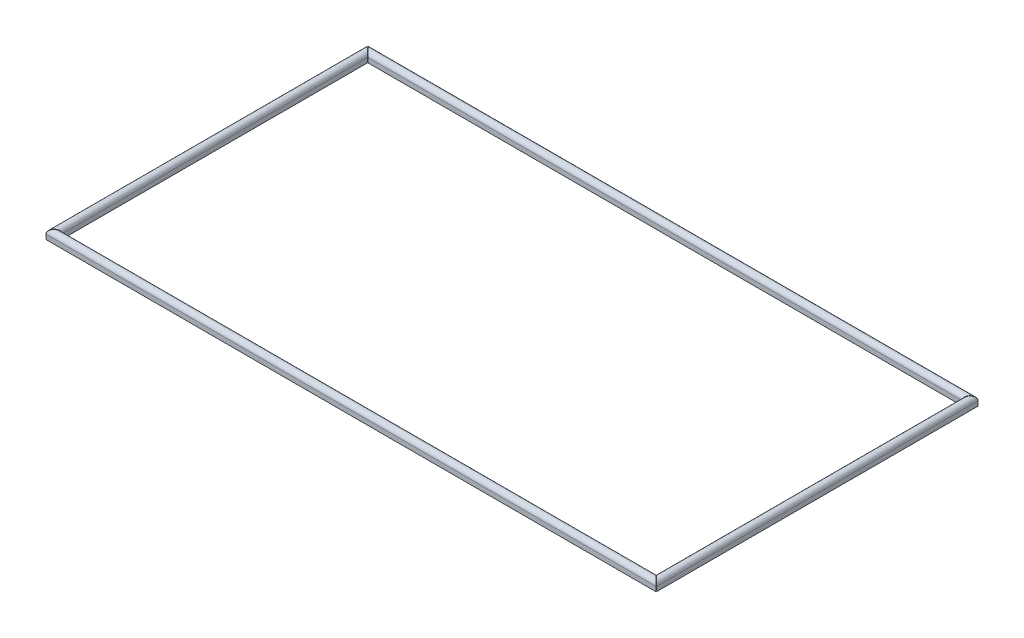
ISO-10303-21;
HEADER;
FILE_DESCRIPTION(('STEP AP214'),'2;1');
FILE_NAME('part.step','',(''),(''),'','','');
FILE_SCHEMA(('AUTOMOTIVE_DESIGN { 1 0 10303 214 1 1 1 1 }'));
ENDSEC;
DATA;
#1=APPLICATION_CONTEXT('core data for automotive mechanical design processes');
#2=APPLICATION_PROTOCOL_DEFINITION('international standard','automotive_design',2000,#1);
#3=PRODUCT_CONTEXT('',#1,'mechanical');
#4=PRODUCT('Part','Part','',(#3));
#5=PRODUCT_RELATED_PRODUCT_CATEGORY('part','',(#4));
#6=PRODUCT_DEFINITION_FORMATION('','',#4);
#7=PRODUCT_DEFINITION_CONTEXT('part definition',#1,'design');
#8=PRODUCT_DEFINITION('design','',#6,#7);
#9=PRODUCT_DEFINITION_SHAPE('','',#8);
#10=(LENGTH_UNIT() NAMED_UNIT(*) SI_UNIT(.MILLI.,.METRE.));
#11=(NAMED_UNIT(*) PLANE_ANGLE_UNIT() SI_UNIT($,.RADIAN.));
#12=(NAMED_UNIT(*) SI_UNIT($,.STERADIAN.) SOLID_ANGLE_UNIT());
#13=UNCERTAINTY_MEASURE_WITH_UNIT(LENGTH_MEASURE(1.E-05),#10,'distance_accuracy_value','');
#14=(GEOMETRIC_REPRESENTATION_CONTEXT(3) GLOBAL_UNCERTAINTY_ASSIGNED_CONTEXT((#13)) GLOBAL_UNIT_ASSIGNED_CONTEXT((#10,
#11,#12)) REPRESENTATION_CONTEXT('',''));
#15=CARTESIAN_POINT('',(0.,0.,0.));
#16=DIRECTION('',(0.,0.,1.));
#17=DIRECTION('',(1.,0.,0.));
#18=AXIS2_PLACEMENT_3D('',#15,#16,#17);
#19=CARTESIAN_POINT('',(12.5,7.,-6.));
#20=DIRECTION('',(1.,0.,0.));
#21=DIRECTION('',(0.,0.,-1.));
#22=AXIS2_PLACEMENT_3D('',#19,#20,#21);
#23=CYLINDRICAL_SURFACE('',#22,6.);
#24=DIRECTION('',(1.,0.,0.));
#25=VECTOR('',#24,1.);
#26=CARTESIAN_POINT('',(0.,7.,-12.));
#27=LINE('',#26,#25);
#28=CARTESIAN_POINT('',(12.5,7.,-12.));
#29=VERTEX_POINT('',#28);
#30=CARTESIAN_POINT('',(897.5,7.00000000000001,-12.));
#31=VERTEX_POINT('',#30);
#32=EDGE_CURVE('E116',#29,#31,#27,.T.);
#33=ORIENTED_EDGE('',*,*,#32,.F.);
#34=CARTESIAN_POINT('',(6.49999999999996,7.,-6.));
#35=DIRECTION('',(-0.707106781186549,0.,-0.707106781186546));
#36=DIRECTION('',(0.707106781186546,0.,-0.707106781186549));
#37=AXIS2_PLACEMENT_3D('',#34,#35,#36);
#38=ELLIPSE('',#37,8.48528137423856,6.);
#39=CARTESIAN_POINT('',(0.499999999999982,7.,0.));
#40=VERTEX_POINT('',#39);
#41=EDGE_CURVE('E58',#40,#29,#38,.T.);
#42=ORIENTED_EDGE('',*,*,#41,.F.);
#43=DIRECTION('',(1.,0.,0.));
#44=VECTOR('',#43,1.);
#45=CARTESIAN_POINT('',(0.,7.,0.));
#46=LINE('',#45,#44);
#47=CARTESIAN_POINT('',(909.5,6.99999999999997,0.));
#48=VERTEX_POINT('',#47);
#49=EDGE_CURVE('E122',#48,#40,#46,.F.);
#50=ORIENTED_EDGE('',*,*,#49,.F.);
#51=CARTESIAN_POINT('',(903.5,7.,-6.));
#52=DIRECTION('',(-0.707106781186552,0.,0.707106781186543));
#53=DIRECTION('',(0.707106781186543,0.,0.707106781186552));
#54=AXIS2_PLACEMENT_3D('',#51,#52,#53);
#55=ELLIPSE('',#54,8.48528137423851,6.);
#56=EDGE_CURVE('E12',#31,#48,#55,.F.);
#57=ORIENTED_EDGE('',*,*,#56,.F.);
#58=EDGE_LOOP('',(#33,#42,#50,#57));
#59=FACE_BOUND('',#58,.T.);
#60=ADVANCED_FACE('F50',(#59),#23,.T.);
#61=CARTESIAN_POINT('',(0.,13.,0.));
#62=DIRECTION('',(0.,0.,1.));
#63=DIRECTION('',(1.,0.,0.));
#64=AXIS2_PLACEMENT_3D('',#61,#62,#63);
#65=PLANE('',#64);
#66=DIRECTION('',(0.,1.,0.));
#67=VECTOR('',#66,1.);
#68=CARTESIAN_POINT('',(909.5,-27.,0.));
#69=LINE('',#68,#67);
#70=CARTESIAN_POINT('',(909.5,0.,0.));
#71=VERTEX_POINT('',#70);
#72=EDGE_CURVE('E97',#71,#48,#69,.T.);
#73=ORIENTED_EDGE('',*,*,#72,.T.);
#74=ORIENTED_EDGE('',*,*,#49,.T.);
#75=DIRECTION('',(0.,1.,0.));
#76=VECTOR('',#75,1.);
#77=CARTESIAN_POINT('',(0.499999999999982,-27.,0.));
#78=LINE('',#77,#76);
#79=CARTESIAN_POINT('',(0.499999999999982,0.,0.));
#80=VERTEX_POINT('',#79);
#81=EDGE_CURVE('E106',#80,#40,#78,.T.);
#82=ORIENTED_EDGE('',*,*,#81,.F.);
#83=DIRECTION('',(-1.,0.,0.));
#84=VECTOR('',#83,1.);
#85=CARTESIAN_POINT('',(0.,0.,0.));
#86=LINE('',#85,#84);
#87=EDGE_CURVE('E105',#71,#80,#86,.T.);
#88=ORIENTED_EDGE('',*,*,#87,.F.);
#89=EDGE_LOOP('',(#73,#74,#82,#88));
#90=FACE_BOUND('',#89,.T.);
#91=ADVANCED_FACE('F124',(#90),#65,.T.);
#92=CARTESIAN_POINT('',(0.,13.,-12.));
#93=DIRECTION('',(0.,0.,-1.));
#94=DIRECTION('',(-1.,0.,0.));
#95=AXIS2_PLACEMENT_3D('',#92,#93,#94);
#96=PLANE('',#95);
#97=DIRECTION('',(0.,1.,0.));
#98=VECTOR('',#97,1.);
#99=CARTESIAN_POINT('',(12.5,-27.,-12.));
#100=LINE('',#99,#98);
#101=CARTESIAN_POINT('',(12.4999999999999,0.,-12.));
#102=VERTEX_POINT('',#101);
#103=EDGE_CURVE('E87',#102,#29,#100,.T.);
#104=ORIENTED_EDGE('',*,*,#103,.T.);
#105=ORIENTED_EDGE('',*,*,#32,.T.);
#106=DIRECTION('',(0.,1.,0.));
#107=VECTOR('',#106,1.);
#108=CARTESIAN_POINT('',(897.5,-27.,-12.));
#109=LINE('',#108,#107);
#110=CARTESIAN_POINT('',(897.5,0.,-12.));
#111=VERTEX_POINT('',#110);
#112=EDGE_CURVE('E107',#111,#31,#109,.T.);
#113=ORIENTED_EDGE('',*,*,#112,.F.);
#114=DIRECTION('',(1.,0.,0.));
#115=VECTOR('',#114,1.);
#116=CARTESIAN_POINT('',(0.,0.,-12.));
#117=LINE('',#116,#115);
#118=EDGE_CURVE('E96',#102,#111,#117,.T.);
#119=ORIENTED_EDGE('',*,*,#118,.F.);
#120=EDGE_LOOP('',(#104,#105,#113,#119));
#121=FACE_BOUND('',#120,.T.);
#122=ADVANCED_FACE('F110',(#121),#96,.T.);
#123=CARTESIAN_POINT('',(0.,0.,0.));
#124=DIRECTION('',(0.,1.,0.));
#125=DIRECTION('',(0.,0.,1.));
#126=AXIS2_PLACEMENT_3D('',#123,#124,#125);
#127=PLANE('',#126);
#128=DIRECTION('',(-0.707106781186546,0.,0.707106781186549));
#129=VECTOR('',#128,1.);
#130=CARTESIAN_POINT('',(0.249999999999991,0.,0.24999999999999));
#131=LINE('',#130,#129);
#132=EDGE_CURVE('E91',#102,#80,#131,.T.);
#133=ORIENTED_EDGE('',*,*,#132,.F.);
#134=ORIENTED_EDGE('',*,*,#118,.T.);
#135=DIRECTION('',(0.707106781186543,0.,0.707106781186552));
#136=VECTOR('',#135,1.);
#137=CARTESIAN_POINT('',(454.750000000006,0.,-454.75));
#138=LINE('',#137,#136);
#139=EDGE_CURVE('E111',#111,#71,#138,.T.);
#140=ORIENTED_EDGE('',*,*,#139,.T.);
#141=ORIENTED_EDGE('',*,*,#87,.T.);
#142=EDGE_LOOP('',(#133,#134,#140,#141));
#143=FACE_BOUND('',#142,.T.);
#144=ADVANCED_FACE('F102',(#143),#127,.F.);
#145=CARTESIAN_POINT('',(454.750000000006,-27.,-454.75));
#146=DIRECTION('',(-0.707106781186552,0.,0.707106781186543));
#147=DIRECTION('',(0.707106781186543,0.,0.707106781186552));
#148=AXIS2_PLACEMENT_3D('',#145,#146,#147);
#149=PLANE('',#148);
#150=ORIENTED_EDGE('',*,*,#112,.T.);
#151=ORIENTED_EDGE('',*,*,#56,.T.);
#152=ORIENTED_EDGE('',*,*,#72,.F.);
#153=ORIENTED_EDGE('',*,*,#139,.F.);
#154=EDGE_LOOP('',(#150,#151,#152,#153));
#155=FACE_BOUND('',#154,.T.);
#156=ADVANCED_FACE('F125',(#155),#149,.F.);
#157=CARTESIAN_POINT('',(0.249999999999991,-27.,0.24999999999999));
#158=DIRECTION('',(-0.707106781186549,0.,-0.707106781186546));
#159=DIRECTION('',(-0.707106781186546,0.,0.707106781186549));
#160=AXIS2_PLACEMENT_3D('',#157,#158,#159);
#161=PLANE('',#160);
#162=ORIENTED_EDGE('',*,*,#81,.T.);
#163=ORIENTED_EDGE('',*,*,#41,.T.);
#164=ORIENTED_EDGE('',*,*,#103,.F.);
#165=ORIENTED_EDGE('',*,*,#132,.T.);
#166=EDGE_LOOP('',(#162,#163,#164,#165));
#167=FACE_BOUND('',#166,.T.);
#168=ADVANCED_FACE('F90',(#167),#161,.T.);
#169=CLOSED_SHELL('',(#60,#91,#122,#144,#156,#168));
#170=MANIFOLD_SOLID_BREP('B2',#169);
#171=CARTESIAN_POINT('',(6.00000000000001,6.99999999999997,-467.5));
#172=DIRECTION('',(0.,0.,1.));
#173=DIRECTION('',(1.,0.,0.));
#174=AXIS2_PLACEMENT_3D('',#171,#172,#173);
#175=CYLINDRICAL_SURFACE('',#174,6.00000000000003);
#176=DIRECTION('',(0.,0.,1.));
#177=VECTOR('',#176,1.);
#178=CARTESIAN_POINT('',(12.,6.99999999999997,0.));
#179=LINE('',#178,#177);
#180=CARTESIAN_POINT('',(12.,6.99999999999997,-467.5));
#181=VERTEX_POINT('',#180);
#182=CARTESIAN_POINT('',(12.,6.99999999999998,-12.5000000000001));
#183=VERTEX_POINT('',#182);
#184=EDGE_CURVE('E278',#181,#183,#179,.T.);
#185=ORIENTED_EDGE('',*,*,#184,.F.);
#186=CARTESIAN_POINT('',(6.00000000000001,6.99999999999997,-473.5));
#187=DIRECTION('',(-0.707106781186547,0.,0.707106781186548));
#188=DIRECTION('',(0.707106781186548,0.,0.707106781186547));
#189=AXIS2_PLACEMENT_3D('',#186,#187,#188);
#190=ELLIPSE('',#189,8.48528137423861,6.00000000000003);
#191=CARTESIAN_POINT('',(0.,6.99999999999999,-479.5));
#192=VERTEX_POINT('',#191);
#193=EDGE_CURVE('E217',#192,#181,#190,.F.);
#194=ORIENTED_EDGE('',*,*,#193,.F.);
#195=DIRECTION('',(0.,0.,-1.));
#196=VECTOR('',#195,1.);
#197=CARTESIAN_POINT('',(0.,6.99999999999997,-467.5));
#198=LINE('',#197,#196);
#199=CARTESIAN_POINT('',(0.,6.99999999999998,-0.50000000000013));
#200=VERTEX_POINT('',#199);
#201=EDGE_CURVE('E281',#200,#192,#198,.T.);
#202=ORIENTED_EDGE('',*,*,#201,.F.);
#203=CARTESIAN_POINT('',(6.00000000000004,6.99999999999997,-6.50000000000012));
#204=DIRECTION('',(0.707106781186547,0.,0.707106781186548));
#205=DIRECTION('',(-0.707106781186548,0.,0.707106781186547));
#206=AXIS2_PLACEMENT_3D('',#203,#204,#205);
#207=ELLIPSE('',#206,8.48528137423861,6.00000000000003);
#208=EDGE_CURVE('E48',#183,#200,#207,.T.);
#209=ORIENTED_EDGE('',*,*,#208,.F.);
#210=EDGE_LOOP('',(#185,#194,#202,#209));
#211=FACE_BOUND('',#210,.T.);
#212=ADVANCED_FACE('F209',(#211),#175,.T.);
#213=CARTESIAN_POINT('',(0.,0.,0.));
#214=DIRECTION('',(0.,1.,0.));
#215=DIRECTION('',(0.,0.,1.));
#216=AXIS2_PLACEMENT_3D('',#213,#214,#215);
#217=PLANE('',#216);
#218=DIRECTION('',(0.707106781186548,0.,-0.707106781186547));
#219=VECTOR('',#218,1.);
#220=CARTESIAN_POINT('',(-0.250000000000065,0.,-0.250000000000065));
#221=LINE('',#220,#219);
#222=CARTESIAN_POINT('',(0.,0.,-0.50000000000013));
#223=VERTEX_POINT('',#222);
#224=CARTESIAN_POINT('',(12.,0.,-12.5000000000001));
#225=VERTEX_POINT('',#224);
#226=EDGE_CURVE('E276',#223,#225,#221,.T.);
#227=ORIENTED_EDGE('',*,*,#226,.F.);
#228=DIRECTION('',(0.,0.,1.));
#229=VECTOR('',#228,1.);
#230=CARTESIAN_POINT('',(0.,0.,0.));
#231=LINE('',#230,#229);
#232=CARTESIAN_POINT('',(0.,0.,-479.5));
#233=VERTEX_POINT('',#232);
#234=EDGE_CURVE('E256',#233,#223,#231,.T.);
#235=ORIENTED_EDGE('',*,*,#234,.F.);
#236=DIRECTION('',(0.707106781186548,0.,0.707106781186547));
#237=VECTOR('',#236,1.);
#238=CARTESIAN_POINT('',(239.75,0.,-239.75));
#239=LINE('',#238,#237);
#240=CARTESIAN_POINT('',(12.,0.,-467.5));
#241=VERTEX_POINT('',#240);
#242=EDGE_CURVE('E250',#233,#241,#239,.T.);
#243=ORIENTED_EDGE('',*,*,#242,.T.);
#244=DIRECTION('',(0.,0.,1.));
#245=VECTOR('',#244,1.);
#246=CARTESIAN_POINT('',(12.,0.,0.));
#247=LINE('',#246,#245);
#248=EDGE_CURVE('E263',#241,#225,#247,.T.);
#249=ORIENTED_EDGE('',*,*,#248,.T.);
#250=EDGE_LOOP('',(#227,#235,#243,#249));
#251=FACE_BOUND('',#250,.T.);
#252=ADVANCED_FACE('F262',(#251),#217,.F.);
#253=CARTESIAN_POINT('',(0.,13.,0.));
#254=DIRECTION('',(1.,0.,0.));
#255=DIRECTION('',(0.,0.,-1.));
#256=AXIS2_PLACEMENT_3D('',#253,#254,#255);
#257=PLANE('',#256);
#258=DIRECTION('',(0.,1.,0.));
#259=VECTOR('',#258,1.);
#260=CARTESIAN_POINT('',(0.,-27.,-0.50000000000013));
#261=LINE('',#260,#259);
#262=EDGE_CURVE('E269',#223,#200,#261,.T.);
#263=ORIENTED_EDGE('',*,*,#262,.T.);
#264=ORIENTED_EDGE('',*,*,#201,.T.);
#265=DIRECTION('',(0.,1.,0.));
#266=VECTOR('',#265,1.);
#267=CARTESIAN_POINT('',(0.,-27.,-479.5));
#268=LINE('',#267,#266);
#269=EDGE_CURVE('E255',#233,#192,#268,.T.);
#270=ORIENTED_EDGE('',*,*,#269,.F.);
#271=ORIENTED_EDGE('',*,*,#234,.T.);
#272=EDGE_LOOP('',(#263,#264,#270,#271));
#273=FACE_BOUND('',#272,.T.);
#274=ADVANCED_FACE('F283',(#273),#257,.F.);
#275=CARTESIAN_POINT('',(12.,13.,0.));
#276=DIRECTION('',(1.,0.,0.));
#277=DIRECTION('',(0.,0.,-1.));
#278=AXIS2_PLACEMENT_3D('',#275,#276,#277);
#279=PLANE('',#278);
#280=DIRECTION('',(0.,1.,0.));
#281=VECTOR('',#280,1.);
#282=CARTESIAN_POINT('',(12.,-27.,-467.5));
#283=LINE('',#282,#281);
#284=EDGE_CURVE('E246',#241,#181,#283,.T.);
#285=ORIENTED_EDGE('',*,*,#284,.T.);
#286=ORIENTED_EDGE('',*,*,#184,.T.);
#287=DIRECTION('',(0.,1.,0.));
#288=VECTOR('',#287,1.);
#289=CARTESIAN_POINT('',(12.,-27.,-12.5000000000001));
#290=LINE('',#289,#288);
#291=EDGE_CURVE('E268',#225,#183,#290,.T.);
#292=ORIENTED_EDGE('',*,*,#291,.F.);
#293=ORIENTED_EDGE('',*,*,#248,.F.);
#294=EDGE_LOOP('',(#285,#286,#292,#293));
#295=FACE_BOUND('',#294,.T.);
#296=ADVANCED_FACE('F267',(#295),#279,.T.);
#297=CARTESIAN_POINT('',(239.75,-27.,-239.75));
#298=DIRECTION('',(-0.707106781186547,0.,0.707106781186548));
#299=DIRECTION('',(0.707106781186548,0.,0.707106781186547));
#300=AXIS2_PLACEMENT_3D('',#297,#298,#299);
#301=PLANE('',#300);
#302=ORIENTED_EDGE('',*,*,#269,.T.);
#303=ORIENTED_EDGE('',*,*,#193,.T.);
#304=ORIENTED_EDGE('',*,*,#284,.F.);
#305=ORIENTED_EDGE('',*,*,#242,.F.);
#306=EDGE_LOOP('',(#302,#303,#304,#305));
#307=FACE_BOUND('',#306,.T.);
#308=ADVANCED_FACE('F249',(#307),#301,.F.);
#309=CARTESIAN_POINT('',(-0.250000000000065,-27.,-0.250000000000065));
#310=DIRECTION('',(0.707106781186547,0.,0.707106781186548));
#311=DIRECTION('',(0.707106781186548,0.,-0.707106781186547));
#312=AXIS2_PLACEMENT_3D('',#309,#310,#311);
#313=PLANE('',#312);
#314=ORIENTED_EDGE('',*,*,#291,.T.);
#315=ORIENTED_EDGE('',*,*,#208,.T.);
#316=ORIENTED_EDGE('',*,*,#262,.F.);
#317=ORIENTED_EDGE('',*,*,#226,.T.);
#318=EDGE_LOOP('',(#314,#315,#316,#317));
#319=FACE_BOUND('',#318,.T.);
#320=ADVANCED_FACE('F284',(#319),#313,.T.);
#321=CLOSED_SHELL('',(#212,#252,#274,#296,#308,#320));
#322=MANIFOLD_SOLID_BREP('B6',#321);
#323=CARTESIAN_POINT('',(0.50000000000011,6.99999999999999,-474.));
#324=DIRECTION('',(-1.,0.,0.));
#325=DIRECTION('',(0.,0.,1.));
#326=AXIS2_PLACEMENT_3D('',#323,#324,#325);
#327=CYLINDRICAL_SURFACE('',#326,6.00000000000001);
#328=DIRECTION('',(1.,0.,0.));
#329=VECTOR('',#328,1.);
#330=CARTESIAN_POINT('',(0.500000000000109,6.99999999999999,-480.));
#331=LINE('',#330,#329);
#332=CARTESIAN_POINT('',(0.500000000000109,6.99999999999999,-480.));
#333=VERTEX_POINT('',#332);
#334=CARTESIAN_POINT('',(909.5,6.99999999999999,-480.));
#335=VERTEX_POINT('',#334);
#336=EDGE_CURVE('E435',#333,#335,#331,.T.);
#337=ORIENTED_EDGE('',*,*,#336,.F.);
#338=CARTESIAN_POINT('',(6.50000000000008,6.99999999999999,-474.));
#339=DIRECTION('',(0.707106781186549,0.,-0.707106781186546));
#340=DIRECTION('',(-0.707106781186546,0.,-0.707106781186549));
#341=AXIS2_PLACEMENT_3D('',#338,#339,#340);
#342=ELLIPSE('',#341,8.48528137423856,6.00000000000001);
#343=CARTESIAN_POINT('',(12.5000000000002,6.99999999999999,-468.));
#344=VERTEX_POINT('',#343);
#345=EDGE_CURVE('E376',#344,#333,#342,.F.);
#346=ORIENTED_EDGE('',*,*,#345,.F.);
#347=DIRECTION('',(-1.,0.,0.));
#348=VECTOR('',#347,1.);
#349=CARTESIAN_POINT('',(0.,6.99999999999999,-468.));
#350=LINE('',#349,#348);
#351=CARTESIAN_POINT('',(897.5,6.99999999999999,-468.));
#352=VERTEX_POINT('',#351);
#353=EDGE_CURVE('E439',#352,#344,#350,.T.);
#354=ORIENTED_EDGE('',*,*,#353,.F.);
#355=CARTESIAN_POINT('',(903.5,6.99999999999999,-474.));
#356=DIRECTION('',(0.707106781186552,0.,0.707106781186543));
#357=DIRECTION('',(-0.707106781186543,0.,0.707106781186552));
#358=AXIS2_PLACEMENT_3D('',#355,#356,#357);
#359=ELLIPSE('',#358,8.48528137423852,6.00000000000001);
#360=EDGE_CURVE('E207',#335,#352,#359,.T.);
#361=ORIENTED_EDGE('',*,*,#360,.F.);
#362=EDGE_LOOP('',(#337,#346,#354,#361));
#363=FACE_BOUND('',#362,.T.);
#364=ADVANCED_FACE('F368',(#363),#327,.T.);
#365=CARTESIAN_POINT('',(0.,0.,0.));
#366=DIRECTION('',(0.,1.,0.));
#367=DIRECTION('',(0.,0.,1.));
#368=AXIS2_PLACEMENT_3D('',#365,#366,#367);
#369=PLANE('',#368);
#370=DIRECTION('',(0.707106781186543,0.,-0.707106781186552));
#371=VECTOR('',#370,1.);
#372=CARTESIAN_POINT('',(214.750000000006,0.,214.750000000003));
#373=LINE('',#372,#371);
#374=CARTESIAN_POINT('',(897.5,0.,-468.));
#375=VERTEX_POINT('',#374);
#376=CARTESIAN_POINT('',(909.5,0.,-480.));
#377=VERTEX_POINT('',#376);
#378=EDGE_CURVE('E407',#375,#377,#373,.T.);
#379=ORIENTED_EDGE('',*,*,#378,.F.);
#380=DIRECTION('',(-1.,0.,0.));
#381=VECTOR('',#380,1.);
#382=CARTESIAN_POINT('',(0.,0.,-468.));
#383=LINE('',#382,#381);
#384=CARTESIAN_POINT('',(12.5000000000002,0.,-468.));
#385=VERTEX_POINT('',#384);
#386=EDGE_CURVE('E419',#375,#385,#383,.T.);
#387=ORIENTED_EDGE('',*,*,#386,.T.);
#388=DIRECTION('',(-0.707106781186546,0.,-0.707106781186549));
#389=VECTOR('',#388,1.);
#390=CARTESIAN_POINT('',(240.25,0.,-240.249999999999));
#391=LINE('',#390,#389);
#392=CARTESIAN_POINT('',(0.500000000000109,0.,-480.));
#393=VERTEX_POINT('',#392);
#394=EDGE_CURVE('E427',#385,#393,#391,.T.);
#395=ORIENTED_EDGE('',*,*,#394,.T.);
#396=DIRECTION('',(-1.,0.,0.));
#397=VECTOR('',#396,1.);
#398=CARTESIAN_POINT('',(0.,0.,-480.));
#399=LINE('',#398,#397);
#400=EDGE_CURVE('E421',#377,#393,#399,.T.);
#401=ORIENTED_EDGE('',*,*,#400,.F.);
#402=EDGE_LOOP('',(#379,#387,#395,#401));
#403=FACE_BOUND('',#402,.T.);
#404=ADVANCED_FACE('F417',(#403),#369,.F.);
#405=CARTESIAN_POINT('',(0.,13.,-480.));
#406=DIRECTION('',(0.,0.,1.));
#407=DIRECTION('',(1.,0.,0.));
#408=AXIS2_PLACEMENT_3D('',#405,#406,#407);
#409=PLANE('',#408);
#410=DIRECTION('',(0.,1.,0.));
#411=VECTOR('',#410,1.);
#412=CARTESIAN_POINT('',(0.500000000000109,-27.,-480.));
#413=LINE('',#412,#411);
#414=EDGE_CURVE('E412',#393,#333,#413,.T.);
#415=ORIENTED_EDGE('',*,*,#414,.T.);
#416=ORIENTED_EDGE('',*,*,#336,.T.);
#417=DIRECTION('',(0.,1.,0.));
#418=VECTOR('',#417,1.);
#419=CARTESIAN_POINT('',(909.5,-27.,-480.));
#420=LINE('',#419,#418);
#421=EDGE_CURVE('E422',#377,#335,#420,.T.);
#422=ORIENTED_EDGE('',*,*,#421,.F.);
#423=ORIENTED_EDGE('',*,*,#400,.T.);
#424=EDGE_LOOP('',(#415,#416,#422,#423));
#425=FACE_BOUND('',#424,.T.);
#426=ADVANCED_FACE('F443',(#425),#409,.F.);
#427=CARTESIAN_POINT('',(0.,13.,-468.));
#428=DIRECTION('',(0.,0.,1.));
#429=DIRECTION('',(1.,0.,0.));
#430=AXIS2_PLACEMENT_3D('',#427,#428,#429);
#431=PLANE('',#430);
#432=DIRECTION('',(0.,1.,0.));
#433=VECTOR('',#432,1.);
#434=CARTESIAN_POINT('',(897.5,-27.,-468.));
#435=LINE('',#434,#433);
#436=EDGE_CURVE('E404',#375,#352,#435,.T.);
#437=ORIENTED_EDGE('',*,*,#436,.T.);
#438=ORIENTED_EDGE('',*,*,#353,.T.);
#439=DIRECTION('',(0.,1.,0.));
#440=VECTOR('',#439,1.);
#441=CARTESIAN_POINT('',(12.5000000000002,-27.,-468.));
#442=LINE('',#441,#440);
#443=EDGE_CURVE('E411',#385,#344,#442,.T.);
#444=ORIENTED_EDGE('',*,*,#443,.F.);
#445=ORIENTED_EDGE('',*,*,#386,.F.);
#446=EDGE_LOOP('',(#437,#438,#444,#445));
#447=FACE_BOUND('',#446,.T.);
#448=ADVANCED_FACE('F425',(#447),#431,.T.);
#449=CARTESIAN_POINT('',(240.25,-27.,-240.249999999999));
#450=DIRECTION('',(0.707106781186549,0.,-0.707106781186546));
#451=DIRECTION('',(-0.707106781186546,0.,-0.707106781186549));
#452=AXIS2_PLACEMENT_3D('',#449,#450,#451);
#453=PLANE('',#452);
#454=ORIENTED_EDGE('',*,*,#443,.T.);
#455=ORIENTED_EDGE('',*,*,#345,.T.);
#456=ORIENTED_EDGE('',*,*,#414,.F.);
#457=ORIENTED_EDGE('',*,*,#394,.F.);
#458=EDGE_LOOP('',(#454,#455,#456,#457));
#459=FACE_BOUND('',#458,.T.);
#460=ADVANCED_FACE('F441',(#459),#453,.F.);
#461=CARTESIAN_POINT('',(214.750000000006,-27.,214.750000000003));
#462=DIRECTION('',(0.707106781186552,0.,0.707106781186543));
#463=DIRECTION('',(0.707106781186543,0.,-0.707106781186552));
#464=AXIS2_PLACEMENT_3D('',#461,#462,#463);
#465=PLANE('',#464);
#466=ORIENTED_EDGE('',*,*,#421,.T.);
#467=ORIENTED_EDGE('',*,*,#360,.T.);
#468=ORIENTED_EDGE('',*,*,#436,.F.);
#469=ORIENTED_EDGE('',*,*,#378,.T.);
#470=EDGE_LOOP('',(#466,#467,#468,#469));
#471=FACE_BOUND('',#470,.T.);
#472=ADVANCED_FACE('F406',(#471),#465,.T.);
#473=CLOSED_SHELL('',(#364,#404,#426,#448,#460,#472));
#474=MANIFOLD_SOLID_BREP('B42',#473);
#475=CARTESIAN_POINT('',(904.,7.0000000000001,-12.5000000000002));
#476=DIRECTION('',(0.,0.,-1.));
#477=DIRECTION('',(-1.,0.,0.));
#478=AXIS2_PLACEMENT_3D('',#475,#476,#477);
#479=CYLINDRICAL_SURFACE('',#478,5.99999999999993);
#480=DIRECTION('',(0.,0.,-1.));
#481=VECTOR('',#480,1.);
#482=CARTESIAN_POINT('',(898.,7.0000000000001,0.));
#483=LINE('',#482,#481);
#484=CARTESIAN_POINT('',(898.,7.0000000000001,-12.5000000000002));
#485=VERTEX_POINT('',#484);
#486=CARTESIAN_POINT('',(898.,6.99999999999999,-467.5));
#487=VERTEX_POINT('',#486);
#488=EDGE_CURVE('E583',#485,#487,#483,.T.);
#489=ORIENTED_EDGE('',*,*,#488,.F.);
#490=CARTESIAN_POINT('',(904.,7.0000000000001,-6.50000000000022));
#491=DIRECTION('',(0.707106781186547,0.,-0.707106781186548));
#492=DIRECTION('',(-0.707106781186548,0.,-0.707106781186547));
#493=AXIS2_PLACEMENT_3D('',#490,#491,#492);
#494=ELLIPSE('',#493,8.48528137423847,5.99999999999993);
#495=CARTESIAN_POINT('',(910.,6.99999999999999,-0.500000000000112));
#496=VERTEX_POINT('',#495);
#497=EDGE_CURVE('E523',#496,#485,#494,.F.);
#498=ORIENTED_EDGE('',*,*,#497,.F.);
#499=DIRECTION('',(0.,0.,1.));
#500=VECTOR('',#499,1.);
#501=CARTESIAN_POINT('',(910.,7.0000000000001,-12.5000000000002));
#502=LINE('',#501,#500);
#503=CARTESIAN_POINT('',(910.,6.99999999999988,-479.5));
#504=VERTEX_POINT('',#503);
#505=EDGE_CURVE('E571',#504,#496,#502,.T.);
#506=ORIENTED_EDGE('',*,*,#505,.F.);
#507=CARTESIAN_POINT('',(904.,7.0000000000001,-473.5));
#508=DIRECTION('',(-0.707106781186548,0.,-0.707106781186548));
#509=DIRECTION('',(0.707106781186548,0.,-0.707106781186548));
#510=AXIS2_PLACEMENT_3D('',#507,#508,#509);
#511=ELLIPSE('',#510,8.48528137423847,5.99999999999993);
#512=EDGE_CURVE('E366',#487,#504,#511,.T.);
#513=ORIENTED_EDGE('',*,*,#512,.F.);
#514=EDGE_LOOP('',(#489,#498,#506,#513));
#515=FACE_BOUND('',#514,.T.);
#516=ADVANCED_FACE('F515',(#515),#479,.T.);
#517=CARTESIAN_POINT('',(0.,0.,0.));
#518=DIRECTION('',(0.,1.,0.));
#519=DIRECTION('',(0.,0.,1.));
#520=AXIS2_PLACEMENT_3D('',#517,#518,#519);
#521=PLANE('',#520);
#522=DIRECTION('',(-0.707106781186548,0.,0.707106781186548));
#523=VECTOR('',#522,1.);
#524=CARTESIAN_POINT('',(215.25,0.,215.25));
#525=LINE('',#524,#523);
#526=CARTESIAN_POINT('',(910.,0.,-479.5));
#527=VERTEX_POINT('',#526);
#528=CARTESIAN_POINT('',(898.,0.,-467.5));
#529=VERTEX_POINT('',#528);
#530=EDGE_CURVE('E563',#527,#529,#525,.T.);
#531=ORIENTED_EDGE('',*,*,#530,.F.);
#532=DIRECTION('',(0.,0.,-1.));
#533=VECTOR('',#532,1.);
#534=CARTESIAN_POINT('',(910.,0.,0.));
#535=LINE('',#534,#533);
#536=CARTESIAN_POINT('',(910.,0.,-0.500000000000112));
#537=VERTEX_POINT('',#536);
#538=EDGE_CURVE('E570',#537,#527,#535,.T.);
#539=ORIENTED_EDGE('',*,*,#538,.F.);
#540=DIRECTION('',(-0.707106781186548,0.,-0.707106781186547));
#541=VECTOR('',#540,1.);
#542=CARTESIAN_POINT('',(455.25,0.,-455.25));
#543=LINE('',#542,#541);
#544=CARTESIAN_POINT('',(898.,0.,-12.5000000000003));
#545=VERTEX_POINT('',#544);
#546=EDGE_CURVE('E553',#537,#545,#543,.T.);
#547=ORIENTED_EDGE('',*,*,#546,.T.);
#548=DIRECTION('',(0.,0.,-1.));
#549=VECTOR('',#548,1.);
#550=CARTESIAN_POINT('',(898.,0.,0.));
#551=LINE('',#550,#549);
#552=EDGE_CURVE('E564',#545,#529,#551,.T.);
#553=ORIENTED_EDGE('',*,*,#552,.T.);
#554=EDGE_LOOP('',(#531,#539,#547,#553));
#555=FACE_BOUND('',#554,.T.);
#556=ADVANCED_FACE('F574',(#555),#521,.F.);
#557=CARTESIAN_POINT('',(910.,13.,0.));
#558=DIRECTION('',(-1.,0.,0.));
#559=DIRECTION('',(0.,0.,1.));
#560=AXIS2_PLACEMENT_3D('',#557,#558,#559);
#561=PLANE('',#560);
#562=DIRECTION('',(0.,1.,0.));
#563=VECTOR('',#562,1.);
#564=CARTESIAN_POINT('',(910.,-27.,-479.5));
#565=LINE('',#564,#563);
#566=EDGE_CURVE('E575',#527,#504,#565,.T.);
#567=ORIENTED_EDGE('',*,*,#566,.T.);
#568=ORIENTED_EDGE('',*,*,#505,.T.);
#569=DIRECTION('',(0.,1.,0.));
#570=VECTOR('',#569,1.);
#571=CARTESIAN_POINT('',(910.,-27.,-0.500000000000112));
#572=LINE('',#571,#570);
#573=EDGE_CURVE('E556',#537,#496,#572,.T.);
#574=ORIENTED_EDGE('',*,*,#573,.F.);
#575=ORIENTED_EDGE('',*,*,#538,.T.);
#576=EDGE_LOOP('',(#567,#568,#574,#575));
#577=FACE_BOUND('',#576,.T.);
#578=ADVANCED_FACE('F569',(#577),#561,.F.);
#579=CARTESIAN_POINT('',(898.,13.,0.));
#580=DIRECTION('',(-1.,0.,0.));
#581=DIRECTION('',(0.,0.,1.));
#582=AXIS2_PLACEMENT_3D('',#579,#580,#581);
#583=PLANE('',#582);
#584=DIRECTION('',(0.,1.,0.));
#585=VECTOR('',#584,1.);
#586=CARTESIAN_POINT('',(898.,-27.,-12.5000000000002));
#587=LINE('',#586,#585);
#588=EDGE_CURVE('E558',#545,#485,#587,.T.);
#589=ORIENTED_EDGE('',*,*,#588,.T.);
#590=ORIENTED_EDGE('',*,*,#488,.T.);
#591=DIRECTION('',(0.,1.,0.));
#592=VECTOR('',#591,1.);
#593=CARTESIAN_POINT('',(898.,-27.,-467.5));
#594=LINE('',#593,#592);
#595=EDGE_CURVE('E578',#529,#487,#594,.T.);
#596=ORIENTED_EDGE('',*,*,#595,.F.);
#597=ORIENTED_EDGE('',*,*,#552,.F.);
#598=EDGE_LOOP('',(#589,#590,#596,#597));
#599=FACE_BOUND('',#598,.T.);
#600=ADVANCED_FACE('F588',(#599),#583,.T.);
#601=CARTESIAN_POINT('',(455.25,-27.,-455.25));
#602=DIRECTION('',(0.707106781186547,0.,-0.707106781186548));
#603=DIRECTION('',(-0.707106781186548,0.,-0.707106781186547));
#604=AXIS2_PLACEMENT_3D('',#601,#602,#603);
#605=PLANE('',#604);
#606=ORIENTED_EDGE('',*,*,#573,.T.);
#607=ORIENTED_EDGE('',*,*,#497,.T.);
#608=ORIENTED_EDGE('',*,*,#588,.F.);
#609=ORIENTED_EDGE('',*,*,#546,.F.);
#610=EDGE_LOOP('',(#606,#607,#608,#609));
#611=FACE_BOUND('',#610,.T.);
#612=ADVANCED_FACE('F555',(#611),#605,.F.);
#613=CARTESIAN_POINT('',(215.25,-27.,215.25));
#614=DIRECTION('',(-0.707106781186548,0.,-0.707106781186548));
#615=DIRECTION('',(-0.707106781186548,0.,0.707106781186548));
#616=AXIS2_PLACEMENT_3D('',#613,#614,#615);
#617=PLANE('',#616);
#618=ORIENTED_EDGE('',*,*,#595,.T.);
#619=ORIENTED_EDGE('',*,*,#512,.T.);
#620=ORIENTED_EDGE('',*,*,#566,.F.);
#621=ORIENTED_EDGE('',*,*,#530,.T.);
#622=EDGE_LOOP('',(#618,#619,#620,#621));
#623=FACE_BOUND('',#622,.T.);
#624=ADVANCED_FACE('F590',(#623),#617,.T.);
#625=CLOSED_SHELL('',(#516,#556,#578,#600,#612,#624));
#626=MANIFOLD_SOLID_BREP('B201',#625);
#627=ADVANCED_BREP_SHAPE_REPRESENTATION('',(#18,#170,#322,#474,#626),#14);
#628=SHAPE_DEFINITION_REPRESENTATION(#9,#627);
ENDSEC;
END-ISO-10303-21;
